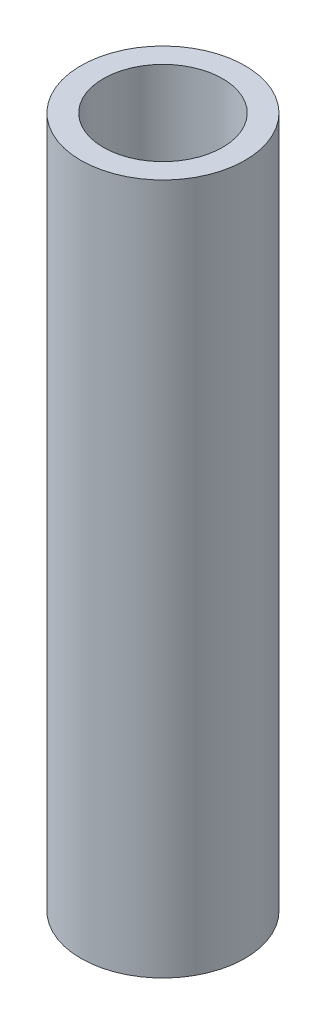
ISO-10303-21;
HEADER;
FILE_DESCRIPTION(('STEP AP214'),'2;1');
FILE_NAME('part.step','',(''),(''),'','','');
FILE_SCHEMA(('AUTOMOTIVE_DESIGN { 1 0 10303 214 1 1 1 1 }'));
ENDSEC;
DATA;
#1=APPLICATION_CONTEXT('core data for automotive mechanical design processes');
#2=APPLICATION_PROTOCOL_DEFINITION('international standard','automotive_design',2000,#1);
#3=PRODUCT_CONTEXT('',#1,'mechanical');
#4=PRODUCT('Part','Part','',(#3));
#5=PRODUCT_RELATED_PRODUCT_CATEGORY('part','',(#4));
#6=PRODUCT_DEFINITION_FORMATION('','',#4);
#7=PRODUCT_DEFINITION_CONTEXT('part definition',#1,'design');
#8=PRODUCT_DEFINITION('design','',#6,#7);
#9=PRODUCT_DEFINITION_SHAPE('','',#8);
#10=(LENGTH_UNIT() NAMED_UNIT(*) SI_UNIT(.MILLI.,.METRE.));
#11=(NAMED_UNIT(*) PLANE_ANGLE_UNIT() SI_UNIT($,.RADIAN.));
#12=(NAMED_UNIT(*) SI_UNIT($,.STERADIAN.) SOLID_ANGLE_UNIT());
#13=UNCERTAINTY_MEASURE_WITH_UNIT(LENGTH_MEASURE(1.E-05),#10,'distance_accuracy_value','');
#14=(GEOMETRIC_REPRESENTATION_CONTEXT(3) GLOBAL_UNCERTAINTY_ASSIGNED_CONTEXT((#13)) GLOBAL_UNIT_ASSIGNED_CONTEXT((#10,
#11,#12)) REPRESENTATION_CONTEXT('',''));
#15=CARTESIAN_POINT('',(0.,0.,0.));
#16=DIRECTION('',(0.,0.,1.));
#17=DIRECTION('',(1.,0.,0.));
#18=AXIS2_PLACEMENT_3D('',#15,#16,#17);
#19=CARTESIAN_POINT('',(0.,20.,0.));
#20=DIRECTION('',(0.,1.,0.));
#21=DIRECTION('',(0.,0.,1.));
#22=AXIS2_PLACEMENT_3D('',#19,#20,#21);
#23=PLANE('',#22);
#24=CARTESIAN_POINT('',(0.,20.,0.));
#25=DIRECTION('',(0.,1.,0.));
#26=DIRECTION('',(0.,0.,1.));
#27=AXIS2_PLACEMENT_3D('',#24,#25,#26);
#28=CIRCLE('',#27,4.75);
#29=CARTESIAN_POINT('',(0.,20.,4.75));
#30=VERTEX_POINT('',#29);
#31=EDGE_CURVE('E10',#30,#30,#28,.T.);
#32=ORIENTED_EDGE('',*,*,#31,.T.);
#33=EDGE_LOOP('',(#32));
#34=FACE_BOUND('',#33,.T.);
#35=CARTESIAN_POINT('',(0.,20.,0.));
#36=DIRECTION('',(0.,1.,0.));
#37=DIRECTION('',(0.,0.,1.));
#38=AXIS2_PLACEMENT_3D('',#35,#36,#37);
#39=CIRCLE('',#38,3.45);
#40=CARTESIAN_POINT('',(0.,20.,3.45));
#41=VERTEX_POINT('',#40);
#42=EDGE_CURVE('E41',#41,#41,#39,.T.);
#43=ORIENTED_EDGE('',*,*,#42,.F.);
#44=EDGE_LOOP('',(#43));
#45=FACE_BOUND('',#44,.T.);
#46=ADVANCED_FACE('F30',(#34,#45),#23,.T.);
#47=CARTESIAN_POINT('',(0.,-20.,0.));
#48=DIRECTION('',(0.,1.,0.));
#49=DIRECTION('',(0.,0.,1.));
#50=AXIS2_PLACEMENT_3D('',#47,#48,#49);
#51=PLANE('',#50);
#52=CARTESIAN_POINT('',(0.,-20.,0.));
#53=DIRECTION('',(0.,1.,0.));
#54=DIRECTION('',(0.,0.,1.));
#55=AXIS2_PLACEMENT_3D('',#52,#53,#54);
#56=CIRCLE('',#55,4.75);
#57=CARTESIAN_POINT('',(0.,-20.,4.75));
#58=VERTEX_POINT('',#57);
#59=EDGE_CURVE('E34',#58,#58,#56,.T.);
#60=ORIENTED_EDGE('',*,*,#59,.F.);
#61=EDGE_LOOP('',(#60));
#62=FACE_BOUND('',#61,.T.);
#63=CARTESIAN_POINT('',(0.,-20.,0.));
#64=DIRECTION('',(0.,1.,0.));
#65=DIRECTION('',(0.,0.,1.));
#66=AXIS2_PLACEMENT_3D('',#63,#64,#65);
#67=CIRCLE('',#66,3.45);
#68=CARTESIAN_POINT('',(0.,-20.,3.45));
#69=VERTEX_POINT('',#68);
#70=EDGE_CURVE('E43',#69,#69,#67,.T.);
#71=ORIENTED_EDGE('',*,*,#70,.T.);
#72=EDGE_LOOP('',(#71));
#73=FACE_BOUND('',#72,.T.);
#74=ADVANCED_FACE('F53',(#62,#73),#51,.F.);
#75=CARTESIAN_POINT('',(0.,20.,0.));
#76=DIRECTION('',(0.,-1.,0.));
#77=DIRECTION('',(0.,0.,-1.));
#78=AXIS2_PLACEMENT_3D('',#75,#76,#77);
#79=CYLINDRICAL_SURFACE('',#78,4.75);
#80=ORIENTED_EDGE('',*,*,#31,.F.);
#81=EDGE_LOOP('',(#80));
#82=FACE_BOUND('',#81,.T.);
#83=ORIENTED_EDGE('',*,*,#59,.T.);
#84=EDGE_LOOP('',(#83));
#85=FACE_BOUND('',#84,.T.);
#86=ADVANCED_FACE('F32',(#82,#85),#79,.T.);
#87=CARTESIAN_POINT('',(0.,20.,0.));
#88=DIRECTION('',(0.,-1.,0.));
#89=DIRECTION('',(0.,0.,-1.));
#90=AXIS2_PLACEMENT_3D('',#87,#88,#89);
#91=CYLINDRICAL_SURFACE('',#90,3.45);
#92=ORIENTED_EDGE('',*,*,#42,.T.);
#93=EDGE_LOOP('',(#92));
#94=FACE_BOUND('',#93,.T.);
#95=ORIENTED_EDGE('',*,*,#70,.F.);
#96=EDGE_LOOP('',(#95));
#97=FACE_BOUND('',#96,.T.);
#98=ADVANCED_FACE('F49',(#94,#97),#91,.F.);
#99=CLOSED_SHELL('',(#46,#74,#86,#98));
#100=MANIFOLD_SOLID_BREP('B2',#99);
#101=ADVANCED_BREP_SHAPE_REPRESENTATION('',(#18,#100),#14);
#102=SHAPE_DEFINITION_REPRESENTATION(#9,#101);
ENDSEC;
END-ISO-10303-21;
